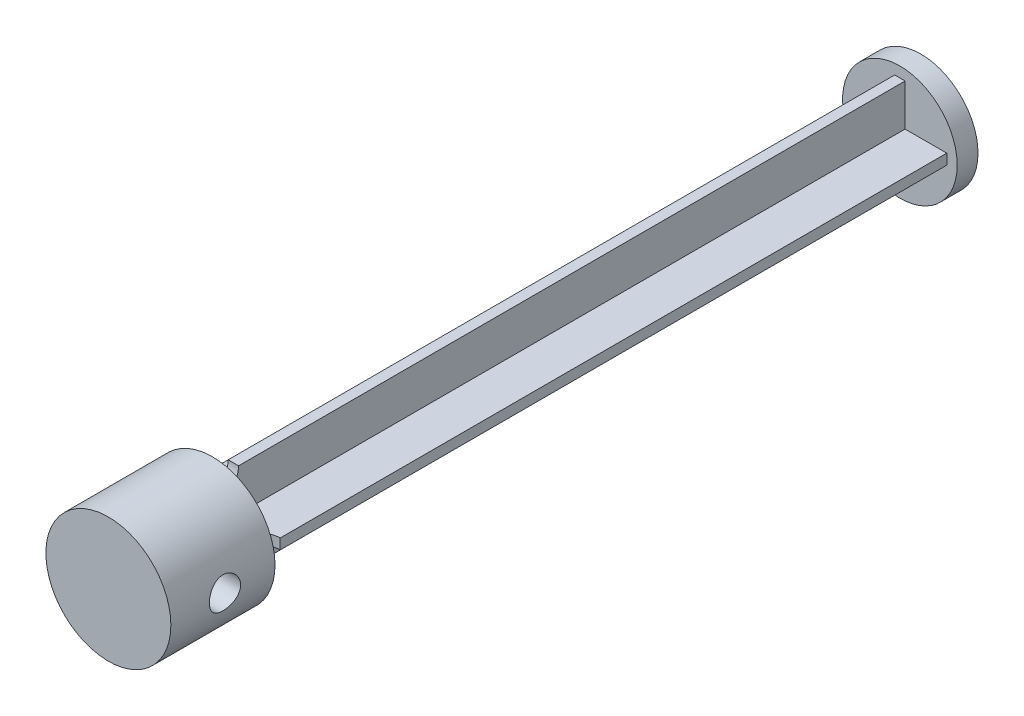
ISO-10303-21;
HEADER;
FILE_DESCRIPTION(('STEP AP214'),'2;1');
FILE_NAME('part.step','',(''),(''),'','','');
FILE_SCHEMA(('AUTOMOTIVE_DESIGN { 1 0 10303 214 1 1 1 1 }'));
ENDSEC;
DATA;
#1=APPLICATION_CONTEXT('core data for automotive mechanical design processes');
#2=APPLICATION_PROTOCOL_DEFINITION('international standard','automotive_design',2000,#1);
#3=PRODUCT_CONTEXT('',#1,'mechanical');
#4=PRODUCT('Part','Part','',(#3));
#5=PRODUCT_RELATED_PRODUCT_CATEGORY('part','',(#4));
#6=PRODUCT_DEFINITION_FORMATION('','',#4);
#7=PRODUCT_DEFINITION_CONTEXT('part definition',#1,'design');
#8=PRODUCT_DEFINITION('design','',#6,#7);
#9=PRODUCT_DEFINITION_SHAPE('','',#8);
#10=(LENGTH_UNIT() NAMED_UNIT(*) SI_UNIT(.MILLI.,.METRE.));
#11=(NAMED_UNIT(*) PLANE_ANGLE_UNIT() SI_UNIT($,.RADIAN.));
#12=(NAMED_UNIT(*) SI_UNIT($,.STERADIAN.) SOLID_ANGLE_UNIT());
#13=UNCERTAINTY_MEASURE_WITH_UNIT(LENGTH_MEASURE(1.E-05),#10,'distance_accuracy_value','');
#14=(GEOMETRIC_REPRESENTATION_CONTEXT(3) GLOBAL_UNCERTAINTY_ASSIGNED_CONTEXT((#13)) GLOBAL_UNIT_ASSIGNED_CONTEXT((#10,
#11,#12)) REPRESENTATION_CONTEXT('',''));
#15=CARTESIAN_POINT('',(0.,0.,0.));
#16=DIRECTION('',(0.,0.,1.));
#17=DIRECTION('',(1.,0.,0.));
#18=AXIS2_PLACEMENT_3D('',#15,#16,#17);
#19=CARTESIAN_POINT('',(0.,0.,2.54));
#20=DIRECTION('',(0.,0.,-1.));
#21=DIRECTION('',(-1.,0.,0.));
#22=AXIS2_PLACEMENT_3D('',#19,#20,#21);
#23=CYLINDRICAL_SURFACE('',#22,6.985);
#24=CARTESIAN_POINT('',(0.,0.,2.54));
#25=DIRECTION('',(0.,0.,1.));
#26=DIRECTION('',(1.,0.,0.));
#27=AXIS2_PLACEMENT_3D('',#24,#25,#26);
#28=CIRCLE('',#27,6.985);
#29=CARTESIAN_POINT('',(6.985,0.,2.54));
#30=VERTEX_POINT('',#29);
#31=EDGE_CURVE('E259',#30,#30,#28,.T.);
#32=ORIENTED_EDGE('',*,*,#31,.F.);
#33=EDGE_LOOP('',(#32));
#34=FACE_BOUND('',#33,.T.);
#35=CARTESIAN_POINT('',(0.,0.,0.));
#36=DIRECTION('',(0.,0.,1.));
#37=DIRECTION('',(1.,0.,0.));
#38=AXIS2_PLACEMENT_3D('',#35,#36,#37);
#39=CIRCLE('',#38,6.985);
#40=CARTESIAN_POINT('',(6.985,0.,0.));
#41=VERTEX_POINT('',#40);
#42=EDGE_CURVE('E258',#41,#41,#39,.T.);
#43=ORIENTED_EDGE('',*,*,#42,.T.);
#44=EDGE_LOOP('',(#43));
#45=FACE_BOUND('',#44,.T.);
#46=ADVANCED_FACE('F36',(#34,#45),#23,.T.);
#47=CARTESIAN_POINT('',(0.,0.,2.54));
#48=DIRECTION('',(0.,0.,1.));
#49=DIRECTION('',(1.,0.,0.));
#50=AXIS2_PLACEMENT_3D('',#47,#48,#49);
#51=PLANE('',#50);
#52=DIRECTION('',(0.,-1.,0.));
#53=VECTOR('',#52,1.);
#54=CARTESIAN_POINT('',(-0.635,-0.635,2.54));
#55=LINE('',#54,#53);
#56=CARTESIAN_POINT('',(-0.635,-0.635,2.54));
#57=VERTEX_POINT('',#56);
#58=CARTESIAN_POINT('',(-0.634999999999999,-5.715,2.54));
#59=VERTEX_POINT('',#58);
#60=EDGE_CURVE('E56',#57,#59,#55,.T.);
#61=ORIENTED_EDGE('',*,*,#60,.F.);
#62=DIRECTION('',(1.,0.,0.));
#63=VECTOR('',#62,1.);
#64=CARTESIAN_POINT('',(-0.635,-0.635,2.54));
#65=LINE('',#64,#63);
#66=CARTESIAN_POINT('',(-5.715,-0.635000000000001,2.54));
#67=VERTEX_POINT('',#66);
#68=EDGE_CURVE('E60',#67,#57,#65,.T.);
#69=ORIENTED_EDGE('',*,*,#68,.F.);
#70=DIRECTION('',(0.,-1.,0.));
#71=VECTOR('',#70,1.);
#72=CARTESIAN_POINT('',(-5.715,-0.635000000000001,2.54));
#73=LINE('',#72,#71);
#74=CARTESIAN_POINT('',(-5.715,0.635000000000001,2.54));
#75=VERTEX_POINT('',#74);
#76=EDGE_CURVE('E223',#75,#67,#73,.T.);
#77=ORIENTED_EDGE('',*,*,#76,.F.);
#78=DIRECTION('',(-1.,0.,0.));
#79=VECTOR('',#78,1.);
#80=CARTESIAN_POINT('',(-0.635,0.635,2.54));
#81=LINE('',#80,#79);
#82=CARTESIAN_POINT('',(-0.635,0.635,2.54));
#83=VERTEX_POINT('',#82);
#84=EDGE_CURVE('E221',#83,#75,#81,.T.);
#85=ORIENTED_EDGE('',*,*,#84,.F.);
#86=DIRECTION('',(0.,-1.,0.));
#87=VECTOR('',#86,1.);
#88=CARTESIAN_POINT('',(-0.635,0.635,2.54));
#89=LINE('',#88,#87);
#90=CARTESIAN_POINT('',(-0.635000000000001,5.715,2.54));
#91=VERTEX_POINT('',#90);
#92=EDGE_CURVE('E218',#91,#83,#89,.T.);
#93=ORIENTED_EDGE('',*,*,#92,.F.);
#94=DIRECTION('',(-1.,0.,0.));
#95=VECTOR('',#94,1.);
#96=CARTESIAN_POINT('',(-0.635000000000001,5.715,2.54));
#97=LINE('',#96,#95);
#98=CARTESIAN_POINT('',(0.634999999999999,5.715,2.54));
#99=VERTEX_POINT('',#98);
#100=EDGE_CURVE('E215',#99,#91,#97,.T.);
#101=ORIENTED_EDGE('',*,*,#100,.F.);
#102=DIRECTION('',(0.,1.,0.));
#103=VECTOR('',#102,1.);
#104=CARTESIAN_POINT('',(0.635,0.635,2.54));
#105=LINE('',#104,#103);
#106=CARTESIAN_POINT('',(0.635,0.635,2.54));
#107=VERTEX_POINT('',#106);
#108=EDGE_CURVE('E212',#107,#99,#105,.T.);
#109=ORIENTED_EDGE('',*,*,#108,.F.);
#110=DIRECTION('',(-1.,0.,0.));
#111=VECTOR('',#110,1.);
#112=CARTESIAN_POINT('',(0.635,0.635,2.54));
#113=LINE('',#112,#111);
#114=CARTESIAN_POINT('',(5.715,0.635,2.54));
#115=VERTEX_POINT('',#114);
#116=EDGE_CURVE('E209',#115,#107,#113,.T.);
#117=ORIENTED_EDGE('',*,*,#116,.F.);
#118=DIRECTION('',(0.,1.,0.));
#119=VECTOR('',#118,1.);
#120=CARTESIAN_POINT('',(5.715,-0.635,2.54));
#121=LINE('',#120,#119);
#122=CARTESIAN_POINT('',(5.715,-0.635,2.54));
#123=VERTEX_POINT('',#122);
#124=EDGE_CURVE('E206',#123,#115,#121,.T.);
#125=ORIENTED_EDGE('',*,*,#124,.F.);
#126=DIRECTION('',(1.,0.,0.));
#127=VECTOR('',#126,1.);
#128=CARTESIAN_POINT('',(0.635,-0.635,2.54));
#129=LINE('',#128,#127);
#130=CARTESIAN_POINT('',(0.635,-0.635,2.54));
#131=VERTEX_POINT('',#130);
#132=EDGE_CURVE('E203',#131,#123,#129,.T.);
#133=ORIENTED_EDGE('',*,*,#132,.F.);
#134=DIRECTION('',(0.,1.,0.));
#135=VECTOR('',#134,1.);
#136=CARTESIAN_POINT('',(0.635,-0.635,2.54));
#137=LINE('',#136,#135);
#138=CARTESIAN_POINT('',(0.634999999999999,-5.715,2.54));
#139=VERTEX_POINT('',#138);
#140=EDGE_CURVE('E200',#139,#131,#137,.T.);
#141=ORIENTED_EDGE('',*,*,#140,.F.);
#142=DIRECTION('',(1.,0.,0.));
#143=VECTOR('',#142,1.);
#144=CARTESIAN_POINT('',(0.634999999999999,-5.715,2.54));
#145=LINE('',#144,#143);
#146=EDGE_CURVE('E180',#59,#139,#145,.T.);
#147=ORIENTED_EDGE('',*,*,#146,.F.);
#148=EDGE_LOOP('',(#61,#69,#77,#85,#93,#101,#109,#117,#125,#133,#141,#147));
#149=FACE_BOUND('',#148,.T.);
#150=ORIENTED_EDGE('',*,*,#31,.T.);
#151=EDGE_LOOP('',(#150));
#152=FACE_BOUND('',#151,.T.);
#153=ADVANCED_FACE('F303',(#149,#152),#51,.T.);
#154=CARTESIAN_POINT('',(0.,0.,0.));
#155=DIRECTION('',(0.,0.,1.));
#156=DIRECTION('',(1.,0.,0.));
#157=AXIS2_PLACEMENT_3D('',#154,#155,#156);
#158=PLANE('',#157);
#159=ORIENTED_EDGE('',*,*,#42,.F.);
#160=EDGE_LOOP('',(#159));
#161=FACE_BOUND('',#160,.T.);
#162=ADVANCED_FACE('F309',(#161),#158,.F.);
#163=CARTESIAN_POINT('',(-0.635,-0.635,83.82));
#164=DIRECTION('',(1.,0.,0.));
#165=DIRECTION('',(0.,1.,0.));
#166=AXIS2_PLACEMENT_3D('',#163,#164,#165);
#167=PLANE('',#166);
#168=ORIENTED_EDGE('',*,*,#60,.T.);
#169=DIRECTION('',(0.,0.,-1.));
#170=VECTOR('',#169,1.);
#171=CARTESIAN_POINT('',(-0.634999999999999,-5.715,83.82));
#172=LINE('',#171,#170);
#173=CARTESIAN_POINT('',(-0.634999999999999,-5.715,83.82));
#174=VERTEX_POINT('',#173);
#175=EDGE_CURVE('E255',#174,#59,#172,.T.);
#176=ORIENTED_EDGE('',*,*,#175,.F.);
#177=CARTESIAN_POINT('',(-0.634999999999999,-5.715,86.36));
#178=DIRECTION('',(1.,0.,0.));
#179=DIRECTION('',(0.,1.,0.));
#180=AXIS2_PLACEMENT_3D('',#177,#178,#179);
#181=CIRCLE('',#180,2.54);
#182=CARTESIAN_POINT('',(-0.635000000000001,-3.175,86.36));
#183=VERTEX_POINT('',#182);
#184=EDGE_CURVE('E266',#174,#183,#181,.T.);
#185=ORIENTED_EDGE('',*,*,#184,.T.);
#186=DIRECTION('',(0.,-1.,0.));
#187=VECTOR('',#186,1.);
#188=CARTESIAN_POINT('',(-0.635000000000001,-3.175,86.36));
#189=LINE('',#188,#187);
#190=CARTESIAN_POINT('',(-0.635,-0.635,86.36));
#191=VERTEX_POINT('',#190);
#192=EDGE_CURVE('E357',#191,#183,#189,.T.);
#193=ORIENTED_EDGE('',*,*,#192,.F.);
#194=DIRECTION('',(0.,0.,-1.));
#195=VECTOR('',#194,1.);
#196=CARTESIAN_POINT('',(-0.635,-0.635,83.82));
#197=LINE('',#196,#195);
#198=EDGE_CURVE('E196',#191,#57,#197,.T.);
#199=ORIENTED_EDGE('',*,*,#198,.T.);
#200=EDGE_LOOP('',(#168,#176,#185,#193,#199));
#201=FACE_BOUND('',#200,.T.);
#202=ADVANCED_FACE('F372',(#201),#167,.F.);
#203=CARTESIAN_POINT('',(0.634999999999999,-5.715,83.82));
#204=DIRECTION('',(0.,1.,0.));
#205=DIRECTION('',(0.,0.,1.));
#206=AXIS2_PLACEMENT_3D('',#203,#204,#205);
#207=PLANE('',#206);
#208=ORIENTED_EDGE('',*,*,#146,.T.);
#209=DIRECTION('',(0.,0.,-1.));
#210=VECTOR('',#209,1.);
#211=CARTESIAN_POINT('',(0.634999999999999,-5.715,83.82));
#212=LINE('',#211,#210);
#213=CARTESIAN_POINT('',(0.634999999999999,-5.715,83.82));
#214=VERTEX_POINT('',#213);
#215=EDGE_CURVE('E252',#214,#139,#212,.T.);
#216=ORIENTED_EDGE('',*,*,#215,.F.);
#217=DIRECTION('',(1.,0.,0.));
#218=VECTOR('',#217,1.);
#219=CARTESIAN_POINT('',(0.634999999999999,-5.715,83.82));
#220=LINE('',#219,#218);
#221=EDGE_CURVE('E186',#174,#214,#220,.T.);
#222=ORIENTED_EDGE('',*,*,#221,.F.);
#223=ORIENTED_EDGE('',*,*,#175,.T.);
#224=EDGE_LOOP('',(#208,#216,#222,#223));
#225=FACE_BOUND('',#224,.T.);
#226=ADVANCED_FACE('F405',(#225),#207,.F.);
#227=CARTESIAN_POINT('',(0.635,-0.635,83.82));
#228=DIRECTION('',(-1.,0.,0.));
#229=DIRECTION('',(0.,-1.,0.));
#230=AXIS2_PLACEMENT_3D('',#227,#228,#229);
#231=PLANE('',#230);
#232=ORIENTED_EDGE('',*,*,#140,.T.);
#233=DIRECTION('',(0.,0.,-1.));
#234=VECTOR('',#233,1.);
#235=CARTESIAN_POINT('',(0.635,-0.635,83.82));
#236=LINE('',#235,#234);
#237=CARTESIAN_POINT('',(0.634999999999999,-0.635,86.36));
#238=VERTEX_POINT('',#237);
#239=EDGE_CURVE('E249',#238,#131,#236,.T.);
#240=ORIENTED_EDGE('',*,*,#239,.F.);
#241=DIRECTION('',(0.,1.,0.));
#242=VECTOR('',#241,1.);
#243=CARTESIAN_POINT('',(0.634999999999999,-3.175,86.36));
#244=LINE('',#243,#242);
#245=CARTESIAN_POINT('',(0.634999999999999,-3.175,86.36));
#246=VERTEX_POINT('',#245);
#247=EDGE_CURVE('E351',#246,#238,#244,.T.);
#248=ORIENTED_EDGE('',*,*,#247,.F.);
#249=CARTESIAN_POINT('',(0.634999999999999,-5.715,86.36));
#250=DIRECTION('',(-1.,0.,0.));
#251=DIRECTION('',(0.,-1.,0.));
#252=AXIS2_PLACEMENT_3D('',#249,#250,#251);
#253=CIRCLE('',#252,2.54);
#254=EDGE_CURVE('E262',#246,#214,#253,.T.);
#255=ORIENTED_EDGE('',*,*,#254,.T.);
#256=ORIENTED_EDGE('',*,*,#215,.T.);
#257=EDGE_LOOP('',(#232,#240,#248,#255,#256));
#258=FACE_BOUND('',#257,.T.);
#259=ADVANCED_FACE('F379',(#258),#231,.F.);
#260=CARTESIAN_POINT('',(0.635,-0.635,83.82));
#261=DIRECTION('',(0.,1.,0.));
#262=DIRECTION('',(-1.,0.,0.));
#263=AXIS2_PLACEMENT_3D('',#260,#261,#262);
#264=PLANE('',#263);
#265=ORIENTED_EDGE('',*,*,#132,.T.);
#266=DIRECTION('',(0.,0.,-1.));
#267=VECTOR('',#266,1.);
#268=CARTESIAN_POINT('',(5.715,-0.635,83.82));
#269=LINE('',#268,#267);
#270=CARTESIAN_POINT('',(5.715,-0.635,83.82));
#271=VERTEX_POINT('',#270);
#272=EDGE_CURVE('E246',#271,#123,#269,.T.);
#273=ORIENTED_EDGE('',*,*,#272,.F.);
#274=CARTESIAN_POINT('',(5.715,-0.635,86.36));
#275=DIRECTION('',(0.,1.,0.));
#276=DIRECTION('',(-1.,0.,0.));
#277=AXIS2_PLACEMENT_3D('',#274,#275,#276);
#278=CIRCLE('',#277,2.54);
#279=CARTESIAN_POINT('',(3.175,-0.635,86.36));
#280=VERTEX_POINT('',#279);
#281=EDGE_CURVE('E270',#271,#280,#278,.T.);
#282=ORIENTED_EDGE('',*,*,#281,.T.);
#283=DIRECTION('',(1.,0.,0.));
#284=VECTOR('',#283,1.);
#285=CARTESIAN_POINT('',(3.175,-0.635,86.36));
#286=LINE('',#285,#284);
#287=EDGE_CURVE('E348',#238,#280,#286,.T.);
#288=ORIENTED_EDGE('',*,*,#287,.F.);
#289=ORIENTED_EDGE('',*,*,#239,.T.);
#290=EDGE_LOOP('',(#265,#273,#282,#288,#289));
#291=FACE_BOUND('',#290,.T.);
#292=ADVANCED_FACE('F382',(#291),#264,.F.);
#293=CARTESIAN_POINT('',(5.715,-0.635,83.82));
#294=DIRECTION('',(-1.,0.,0.));
#295=DIRECTION('',(0.,-1.,0.));
#296=AXIS2_PLACEMENT_3D('',#293,#294,#295);
#297=PLANE('',#296);
#298=ORIENTED_EDGE('',*,*,#124,.T.);
#299=DIRECTION('',(0.,0.,-1.));
#300=VECTOR('',#299,1.);
#301=CARTESIAN_POINT('',(5.715,0.635,83.82));
#302=LINE('',#301,#300);
#303=CARTESIAN_POINT('',(5.715,0.635,83.82));
#304=VERTEX_POINT('',#303);
#305=EDGE_CURVE('E243',#304,#115,#302,.T.);
#306=ORIENTED_EDGE('',*,*,#305,.F.);
#307=DIRECTION('',(0.,1.,0.));
#308=VECTOR('',#307,1.);
#309=CARTESIAN_POINT('',(5.715,-0.635,83.82));
#310=LINE('',#309,#308);
#311=EDGE_CURVE('E189',#271,#304,#310,.T.);
#312=ORIENTED_EDGE('',*,*,#311,.F.);
#313=ORIENTED_EDGE('',*,*,#272,.T.);
#314=EDGE_LOOP('',(#298,#306,#312,#313));
#315=FACE_BOUND('',#314,.T.);
#316=ADVANCED_FACE('F392',(#315),#297,.F.);
#317=CARTESIAN_POINT('',(0.635,0.635,83.82));
#318=DIRECTION('',(0.,-1.,0.));
#319=DIRECTION('',(1.,0.,0.));
#320=AXIS2_PLACEMENT_3D('',#317,#318,#319);
#321=PLANE('',#320);
#322=ORIENTED_EDGE('',*,*,#116,.T.);
#323=DIRECTION('',(0.,0.,-1.));
#324=VECTOR('',#323,1.);
#325=CARTESIAN_POINT('',(0.635,0.635,83.82));
#326=LINE('',#325,#324);
#327=CARTESIAN_POINT('',(0.635,0.635,86.36));
#328=VERTEX_POINT('',#327);
#329=EDGE_CURVE('E240',#328,#107,#326,.T.);
#330=ORIENTED_EDGE('',*,*,#329,.F.);
#331=DIRECTION('',(-1.,0.,0.));
#332=VECTOR('',#331,1.);
#333=CARTESIAN_POINT('',(3.175,0.635,86.36));
#334=LINE('',#333,#332);
#335=CARTESIAN_POINT('',(3.175,0.635,86.36));
#336=VERTEX_POINT('',#335);
#337=EDGE_CURVE('E341',#336,#328,#334,.T.);
#338=ORIENTED_EDGE('',*,*,#337,.F.);
#339=CARTESIAN_POINT('',(5.715,0.635,86.36));
#340=DIRECTION('',(0.,-1.,0.));
#341=DIRECTION('',(1.,0.,0.));
#342=AXIS2_PLACEMENT_3D('',#339,#340,#341);
#343=CIRCLE('',#342,2.54);
#344=EDGE_CURVE('E268',#336,#304,#343,.T.);
#345=ORIENTED_EDGE('',*,*,#344,.T.);
#346=ORIENTED_EDGE('',*,*,#305,.T.);
#347=EDGE_LOOP('',(#322,#330,#338,#345,#346));
#348=FACE_BOUND('',#347,.T.);
#349=ADVANCED_FACE('F388',(#348),#321,.F.);
#350=CARTESIAN_POINT('',(0.635,0.635,83.82));
#351=DIRECTION('',(-1.,0.,0.));
#352=DIRECTION('',(0.,-1.,0.));
#353=AXIS2_PLACEMENT_3D('',#350,#351,#352);
#354=PLANE('',#353);
#355=ORIENTED_EDGE('',*,*,#108,.T.);
#356=DIRECTION('',(0.,0.,-1.));
#357=VECTOR('',#356,1.);
#358=CARTESIAN_POINT('',(0.634999999999999,5.715,83.82));
#359=LINE('',#358,#357);
#360=CARTESIAN_POINT('',(0.634999999999999,5.715,83.82));
#361=VERTEX_POINT('',#360);
#362=EDGE_CURVE('E237',#361,#99,#359,.T.);
#363=ORIENTED_EDGE('',*,*,#362,.F.);
#364=CARTESIAN_POINT('',(0.634999999999999,5.715,86.36));
#365=DIRECTION('',(-1.,0.,0.));
#366=DIRECTION('',(0.,-1.,0.));
#367=AXIS2_PLACEMENT_3D('',#364,#365,#366);
#368=CIRCLE('',#367,2.54);
#369=CARTESIAN_POINT('',(0.634999999999999,3.175,86.36));
#370=VERTEX_POINT('',#369);
#371=EDGE_CURVE('E274',#361,#370,#368,.T.);
#372=ORIENTED_EDGE('',*,*,#371,.T.);
#373=DIRECTION('',(0.,1.,0.));
#374=VECTOR('',#373,1.);
#375=CARTESIAN_POINT('',(0.634999999999999,3.175,86.36));
#376=LINE('',#375,#374);
#377=EDGE_CURVE('E334',#328,#370,#376,.T.);
#378=ORIENTED_EDGE('',*,*,#377,.F.);
#379=ORIENTED_EDGE('',*,*,#329,.T.);
#380=EDGE_LOOP('',(#355,#363,#372,#378,#379));
#381=FACE_BOUND('',#380,.T.);
#382=ADVANCED_FACE('F333',(#381),#354,.F.);
#383=CARTESIAN_POINT('',(-0.635000000000001,5.715,83.82));
#384=DIRECTION('',(0.,-1.,0.));
#385=DIRECTION('',(0.,0.,-1.));
#386=AXIS2_PLACEMENT_3D('',#383,#384,#385);
#387=PLANE('',#386);
#388=ORIENTED_EDGE('',*,*,#100,.T.);
#389=DIRECTION('',(0.,0.,-1.));
#390=VECTOR('',#389,1.);
#391=CARTESIAN_POINT('',(-0.635000000000001,5.715,83.82));
#392=LINE('',#391,#390);
#393=CARTESIAN_POINT('',(-0.635000000000001,5.715,83.82));
#394=VERTEX_POINT('',#393);
#395=EDGE_CURVE('E234',#394,#91,#392,.T.);
#396=ORIENTED_EDGE('',*,*,#395,.F.);
#397=DIRECTION('',(-1.,0.,0.));
#398=VECTOR('',#397,1.);
#399=CARTESIAN_POINT('',(-0.635000000000001,5.715,83.82));
#400=LINE('',#399,#398);
#401=EDGE_CURVE('E192',#361,#394,#400,.T.);
#402=ORIENTED_EDGE('',*,*,#401,.F.);
#403=ORIENTED_EDGE('',*,*,#362,.T.);
#404=EDGE_LOOP('',(#388,#396,#402,#403));
#405=FACE_BOUND('',#404,.T.);
#406=ADVANCED_FACE('F338',(#405),#387,.F.);
#407=CARTESIAN_POINT('',(-0.635,0.635,83.82));
#408=DIRECTION('',(1.,0.,0.));
#409=DIRECTION('',(0.,1.,0.));
#410=AXIS2_PLACEMENT_3D('',#407,#408,#409);
#411=PLANE('',#410);
#412=ORIENTED_EDGE('',*,*,#92,.T.);
#413=DIRECTION('',(0.,0.,-1.));
#414=VECTOR('',#413,1.);
#415=CARTESIAN_POINT('',(-0.635,0.635,83.82));
#416=LINE('',#415,#414);
#417=CARTESIAN_POINT('',(-0.635000000000001,0.635,86.36));
#418=VERTEX_POINT('',#417);
#419=EDGE_CURVE('E232',#418,#83,#416,.T.);
#420=ORIENTED_EDGE('',*,*,#419,.F.);
#421=DIRECTION('',(0.,-1.,0.));
#422=VECTOR('',#421,1.);
#423=CARTESIAN_POINT('',(-0.635000000000001,3.175,86.36));
#424=LINE('',#423,#422);
#425=CARTESIAN_POINT('',(-0.635000000000001,3.175,86.36));
#426=VERTEX_POINT('',#425);
#427=EDGE_CURVE('E178',#426,#418,#424,.T.);
#428=ORIENTED_EDGE('',*,*,#427,.F.);
#429=CARTESIAN_POINT('',(-0.635000000000001,5.715,86.36));
#430=DIRECTION('',(1.,0.,0.));
#431=DIRECTION('',(0.,1.,0.));
#432=AXIS2_PLACEMENT_3D('',#429,#430,#431);
#433=CIRCLE('',#432,2.54);
#434=EDGE_CURVE('E272',#426,#394,#433,.T.);
#435=ORIENTED_EDGE('',*,*,#434,.T.);
#436=ORIENTED_EDGE('',*,*,#395,.T.);
#437=EDGE_LOOP('',(#412,#420,#428,#435,#436));
#438=FACE_BOUND('',#437,.T.);
#439=ADVANCED_FACE('F340',(#438),#411,.F.);
#440=CARTESIAN_POINT('',(-0.635,0.635,83.82));
#441=DIRECTION('',(0.,-1.,0.));
#442=DIRECTION('',(1.,0.,0.));
#443=AXIS2_PLACEMENT_3D('',#440,#441,#442);
#444=PLANE('',#443);
#445=ORIENTED_EDGE('',*,*,#84,.T.);
#446=DIRECTION('',(0.,0.,-1.));
#447=VECTOR('',#446,1.);
#448=CARTESIAN_POINT('',(-5.715,0.635000000000001,83.82));
#449=LINE('',#448,#447);
#450=CARTESIAN_POINT('',(-5.715,0.635000000000001,83.82));
#451=VERTEX_POINT('',#450);
#452=EDGE_CURVE('E172',#451,#75,#449,.T.);
#453=ORIENTED_EDGE('',*,*,#452,.F.);
#454=CARTESIAN_POINT('',(-5.715,0.635000000000001,86.36));
#455=DIRECTION('',(0.,-1.,0.));
#456=DIRECTION('',(1.,0.,0.));
#457=AXIS2_PLACEMENT_3D('',#454,#455,#456);
#458=CIRCLE('',#457,2.54);
#459=CARTESIAN_POINT('',(-3.175,0.635,86.36));
#460=VERTEX_POINT('',#459);
#461=EDGE_CURVE('E155',#451,#460,#458,.T.);
#462=ORIENTED_EDGE('',*,*,#461,.T.);
#463=DIRECTION('',(-1.,0.,0.));
#464=VECTOR('',#463,1.);
#465=CARTESIAN_POINT('',(-3.175,0.635,86.36));
#466=LINE('',#465,#464);
#467=EDGE_CURVE('E169',#418,#460,#466,.T.);
#468=ORIENTED_EDGE('',*,*,#467,.F.);
#469=ORIENTED_EDGE('',*,*,#419,.T.);
#470=EDGE_LOOP('',(#445,#453,#462,#468,#469));
#471=FACE_BOUND('',#470,.T.);
#472=ADVANCED_FACE('F167',(#471),#444,.F.);
#473=CARTESIAN_POINT('',(-5.715,-0.635000000000001,83.82));
#474=DIRECTION('',(1.,0.,0.));
#475=DIRECTION('',(0.,0.,-1.));
#476=AXIS2_PLACEMENT_3D('',#473,#474,#475);
#477=PLANE('',#476);
#478=ORIENTED_EDGE('',*,*,#76,.T.);
#479=DIRECTION('',(0.,0.,-1.));
#480=VECTOR('',#479,1.);
#481=CARTESIAN_POINT('',(-5.715,-0.635000000000001,83.82));
#482=LINE('',#481,#480);
#483=CARTESIAN_POINT('',(-5.715,-0.635000000000001,83.82));
#484=VERTEX_POINT('',#483);
#485=EDGE_CURVE('E228',#484,#67,#482,.T.);
#486=ORIENTED_EDGE('',*,*,#485,.F.);
#487=DIRECTION('',(0.,-1.,0.));
#488=VECTOR('',#487,1.);
#489=CARTESIAN_POINT('',(-5.715,-0.635000000000001,83.82));
#490=LINE('',#489,#488);
#491=EDGE_CURVE('E195',#451,#484,#490,.T.);
#492=ORIENTED_EDGE('',*,*,#491,.F.);
#493=ORIENTED_EDGE('',*,*,#452,.T.);
#494=EDGE_LOOP('',(#478,#486,#492,#493));
#495=FACE_BOUND('',#494,.T.);
#496=ADVANCED_FACE('F453',(#495),#477,.F.);
#497=CARTESIAN_POINT('',(-0.635,-0.635,83.82));
#498=DIRECTION('',(0.,1.,0.));
#499=DIRECTION('',(-1.,0.,0.));
#500=AXIS2_PLACEMENT_3D('',#497,#498,#499);
#501=PLANE('',#500);
#502=ORIENTED_EDGE('',*,*,#68,.T.);
#503=ORIENTED_EDGE('',*,*,#198,.F.);
#504=DIRECTION('',(1.,0.,0.));
#505=VECTOR('',#504,1.);
#506=CARTESIAN_POINT('',(-3.175,-0.635,86.36));
#507=LINE('',#506,#505);
#508=CARTESIAN_POINT('',(-3.175,-0.635,86.36));
#509=VERTEX_POINT('',#508);
#510=EDGE_CURVE('E161',#509,#191,#507,.T.);
#511=ORIENTED_EDGE('',*,*,#510,.F.);
#512=CARTESIAN_POINT('',(-5.715,-0.635000000000001,86.36));
#513=DIRECTION('',(0.,1.,0.));
#514=DIRECTION('',(-1.,0.,0.));
#515=AXIS2_PLACEMENT_3D('',#512,#513,#514);
#516=CIRCLE('',#515,2.54);
#517=EDGE_CURVE('E156',#509,#484,#516,.T.);
#518=ORIENTED_EDGE('',*,*,#517,.T.);
#519=ORIENTED_EDGE('',*,*,#485,.T.);
#520=EDGE_LOOP('',(#502,#503,#511,#518,#519));
#521=FACE_BOUND('',#520,.T.);
#522=ADVANCED_FACE('F319',(#521),#501,.F.);
#523=CARTESIAN_POINT('',(0.634999999999999,-5.715,86.36));
#524=DIRECTION('',(-1.,0.,0.));
#525=DIRECTION('',(0.,0.,1.));
#526=AXIS2_PLACEMENT_3D('',#523,#524,#525);
#527=CYLINDRICAL_SURFACE('',#526,2.54);
#528=ORIENTED_EDGE('',*,*,#184,.F.);
#529=ORIENTED_EDGE('',*,*,#221,.T.);
#530=ORIENTED_EDGE('',*,*,#254,.F.);
#531=DIRECTION('',(1.,0.,0.));
#532=VECTOR('',#531,1.);
#533=CARTESIAN_POINT('',(0.634999999999999,-3.175,86.36));
#534=LINE('',#533,#532);
#535=EDGE_CURVE('E354',#183,#246,#534,.T.);
#536=ORIENTED_EDGE('',*,*,#535,.F.);
#537=EDGE_LOOP('',(#528,#529,#530,#536));
#538=FACE_BOUND('',#537,.T.);
#539=ADVANCED_FACE('F315',(#538),#527,.F.);
#540=CARTESIAN_POINT('',(5.715,0.635,86.36));
#541=DIRECTION('',(0.,-1.,0.));
#542=DIRECTION('',(0.,0.,-1.));
#543=AXIS2_PLACEMENT_3D('',#540,#541,#542);
#544=CYLINDRICAL_SURFACE('',#543,2.54);
#545=ORIENTED_EDGE('',*,*,#281,.F.);
#546=ORIENTED_EDGE('',*,*,#311,.T.);
#547=ORIENTED_EDGE('',*,*,#344,.F.);
#548=DIRECTION('',(0.,1.,0.));
#549=VECTOR('',#548,1.);
#550=CARTESIAN_POINT('',(3.175,0.635,86.36));
#551=LINE('',#550,#549);
#552=EDGE_CURVE('E345',#280,#336,#551,.T.);
#553=ORIENTED_EDGE('',*,*,#552,.F.);
#554=EDGE_LOOP('',(#545,#546,#547,#553));
#555=FACE_BOUND('',#554,.T.);
#556=ADVANCED_FACE('F318',(#555),#544,.F.);
#557=CARTESIAN_POINT('',(-0.635,5.715,86.36));
#558=DIRECTION('',(1.,0.,0.));
#559=DIRECTION('',(0.,1.,0.));
#560=AXIS2_PLACEMENT_3D('',#557,#558,#559);
#561=CYLINDRICAL_SURFACE('',#560,2.54);
#562=ORIENTED_EDGE('',*,*,#371,.F.);
#563=ORIENTED_EDGE('',*,*,#401,.T.);
#564=ORIENTED_EDGE('',*,*,#434,.F.);
#565=DIRECTION('',(-1.,0.,0.));
#566=VECTOR('',#565,1.);
#567=CARTESIAN_POINT('',(-0.635000000000001,3.175,86.36));
#568=LINE('',#567,#566);
#569=EDGE_CURVE('E182',#370,#426,#568,.T.);
#570=ORIENTED_EDGE('',*,*,#569,.F.);
#571=EDGE_LOOP('',(#562,#563,#564,#570));
#572=FACE_BOUND('',#571,.T.);
#573=ADVANCED_FACE('F300',(#572),#561,.F.);
#574=CARTESIAN_POINT('',(-5.715,0.635,86.36));
#575=DIRECTION('',(0.,1.,0.));
#576=DIRECTION('',(0.,0.,1.));
#577=AXIS2_PLACEMENT_3D('',#574,#575,#576);
#578=CYLINDRICAL_SURFACE('',#577,2.54);
#579=ORIENTED_EDGE('',*,*,#461,.F.);
#580=ORIENTED_EDGE('',*,*,#491,.T.);
#581=ORIENTED_EDGE('',*,*,#517,.F.);
#582=DIRECTION('',(0.,-1.,0.));
#583=VECTOR('',#582,1.);
#584=CARTESIAN_POINT('',(-3.175,0.635,86.36));
#585=LINE('',#584,#583);
#586=EDGE_CURVE('E152',#460,#509,#585,.T.);
#587=ORIENTED_EDGE('',*,*,#586,.F.);
#588=EDGE_LOOP('',(#579,#580,#581,#587));
#589=FACE_BOUND('',#588,.T.);
#590=ADVANCED_FACE('F38',(#589),#578,.F.);
#591=CARTESIAN_POINT('',(0.,0.,86.36));
#592=DIRECTION('',(0.,0.,1.));
#593=DIRECTION('',(1.,0.,0.));
#594=AXIS2_PLACEMENT_3D('',#591,#592,#593);
#595=PLANE('',#594);
#596=CARTESIAN_POINT('',(0.,0.,86.36));
#597=DIRECTION('',(0.,0.,1.));
#598=DIRECTION('',(1.,0.,0.));
#599=AXIS2_PLACEMENT_3D('',#596,#597,#598);
#600=CIRCLE('',#599,7.62);
#601=CARTESIAN_POINT('',(7.62,0.,86.36));
#602=VERTEX_POINT('',#601);
#603=EDGE_CURVE('E361',#602,#602,#600,.T.);
#604=ORIENTED_EDGE('',*,*,#603,.F.);
#605=EDGE_LOOP('',(#604));
#606=FACE_BOUND('',#605,.T.);
#607=ORIENTED_EDGE('',*,*,#467,.T.);
#608=ORIENTED_EDGE('',*,*,#586,.T.);
#609=ORIENTED_EDGE('',*,*,#510,.T.);
#610=ORIENTED_EDGE('',*,*,#192,.T.);
#611=ORIENTED_EDGE('',*,*,#535,.T.);
#612=ORIENTED_EDGE('',*,*,#247,.T.);
#613=ORIENTED_EDGE('',*,*,#287,.T.);
#614=ORIENTED_EDGE('',*,*,#552,.T.);
#615=ORIENTED_EDGE('',*,*,#337,.T.);
#616=ORIENTED_EDGE('',*,*,#377,.T.);
#617=ORIENTED_EDGE('',*,*,#569,.T.);
#618=ORIENTED_EDGE('',*,*,#427,.T.);
#619=EDGE_LOOP('',(#607,#608,#609,#610,#611,#612,#613,#614,#615,#616,#617,#618));
#620=FACE_BOUND('',#619,.T.);
#621=ADVANCED_FACE('F175',(#606,#620),#595,.F.);
#622=CARTESIAN_POINT('',(0.,0.,99.06));
#623=DIRECTION('',(0.,0.,-1.));
#624=DIRECTION('',(-1.,0.,0.));
#625=AXIS2_PLACEMENT_3D('',#622,#623,#624);
#626=CYLINDRICAL_SURFACE('',#625,7.62);
#627=CARTESIAN_POINT('',(-7.62,0.,94.3634709835372));
#628=CARTESIAN_POINT('',(-7.61999822032376,-0.105252632610559,94.3634680298498));
#629=CARTESIAN_POINT('',(-7.61779754227422,-0.210538260445071,94.3547187140545));
#630=CARTESIAN_POINT('',(-7.60923184563963,-0.418092031188579,94.3200050413773));
#631=CARTESIAN_POINT('',(-7.6028644668336,-0.520358429525842,94.2940309274241));
#632=CARTESIAN_POINT('',(-7.5866704544169,-0.718846507671875,94.2257531316404));
#633=CARTESIAN_POINT('',(-7.5768479760945,-0.815075285556106,94.1834690591688));
#634=CARTESIAN_POINT('',(-7.55478986635643,-0.999073607518624,94.0838406181803));
#635=CARTESIAN_POINT('',(-7.54255415354644,-1.08684286612293,94.0264957416662));
#636=CARTESIAN_POINT('',(-7.51671615261587,-1.25323844767217,93.8971259806764));
#637=CARTESIAN_POINT('',(-7.50309278078637,-1.33166572637757,93.8248492833391));
#638=CARTESIAN_POINT('',(-7.47615497549262,-1.4754211375482,93.6682066833029));
#639=CARTESIAN_POINT('',(-7.46284057706202,-1.54074779092541,93.5838394173952));
#640=CARTESIAN_POINT('',(-7.43781565138632,-1.65738370935478,93.4038650455807));
#641=CARTESIAN_POINT('',(-7.42613188977668,-1.70847031422521,93.308109580408));
#642=CARTESIAN_POINT('',(-7.40599858411523,-1.79374407385918,93.1090305007311));
#643=CARTESIAN_POINT('',(-7.39754852304441,-1.82793393040797,93.0057080992135));
#644=CARTESIAN_POINT('',(-7.38505605431289,-1.87776464274146,92.7966167408201));
#645=CARTESIAN_POINT('',(-7.3809287366579,-1.89376338078335,92.690938265554));
#646=CARTESIAN_POINT('',(-7.3772949042293,-1.90787245433618,92.4783229008895));
#647=CARTESIAN_POINT('',(-7.37778763769777,-1.90598570010884,92.37138621905));
#648=CARTESIAN_POINT('',(-7.38326190980705,-1.8846628862919,92.1620329077017));
#649=CARTESIAN_POINT('',(-7.38813436012386,-1.86565329204197,92.0595695442765));
#650=CARTESIAN_POINT('',(-7.40164521289134,-1.81130471736696,91.8593344488799));
#651=CARTESIAN_POINT('',(-7.41028388362784,-1.77596457362818,91.7615630516904));
#652=CARTESIAN_POINT('',(-7.43045394658317,-1.6895946369802,91.5723437028971));
#653=CARTESIAN_POINT('',(-7.44201365886165,-1.63841006738581,91.4809695453645));
#654=CARTESIAN_POINT('',(-7.4667073277491,-1.521912470539,91.307954222146));
#655=CARTESIAN_POINT('',(-7.47984155965113,-1.45659697098724,91.2263147634918));
#656=CARTESIAN_POINT('',(-7.50666368285522,-1.31148254934516,91.0726423916053));
#657=CARTESIAN_POINT('',(-7.52035668237023,-1.23132374787065,91.0009497811593));
#658=CARTESIAN_POINT('',(-7.54641576285058,-1.0599571352297,90.871960005608));
#659=CARTESIAN_POINT('',(-7.55878180327757,-0.968748986689097,90.8146632802225));
#660=CARTESIAN_POINT('',(-7.58085519759611,-0.777387178625377,90.7159667390322));
#661=CARTESIAN_POINT('',(-7.59055327362211,-0.67720386937496,90.6746222014141));
#662=CARTESIAN_POINT('',(-7.60613054579101,-0.471012530341468,90.609456005286));
#663=CARTESIAN_POINT('',(-7.61201047240887,-0.365005618921123,90.5856309948862));
#664=CARTESIAN_POINT('',(-7.61918084074646,-0.153085762395342,90.5566998752775));
#665=CARTESIAN_POINT('',(-7.62058487955514,-0.0472398343850333,90.5511303404216));
#666=CARTESIAN_POINT('',(-7.61896882114352,0.16387175099791,90.5575972161477));
#667=CARTESIAN_POINT('',(-7.61594912217145,0.269137459748631,90.5696320418921));
#668=CARTESIAN_POINT('',(-7.60589768031743,0.474490121346138,90.6105840371943));
#669=CARTESIAN_POINT('',(-7.5989260541598,0.574630701090309,90.639248388153));
#670=CARTESIAN_POINT('',(-7.5817565742535,0.76867676141468,90.7123569802533));
#671=CARTESIAN_POINT('',(-7.57155839469763,0.862581611171439,90.7568028150149));
#672=CARTESIAN_POINT('',(-7.54879501066414,1.0433343807259,90.8611108672081));
#673=CARTESIAN_POINT('',(-7.53619101556004,1.1300275111315,90.9212326462811));
#674=CARTESIAN_POINT('',(-7.51007526668022,1.29225879932692,91.0548541677094));
#675=CARTESIAN_POINT('',(-7.49656335649665,1.36779502789572,91.1283562188507));
#676=CARTESIAN_POINT('',(-7.46974575340179,1.50747802145236,91.2888034738097));
#677=CARTESIAN_POINT('',(-7.45645326317847,1.57129971187998,91.3760343663503));
#678=CARTESIAN_POINT('',(-7.43194955539093,1.68339866394612,91.5602414293087));
#679=CARTESIAN_POINT('',(-7.42073824545123,1.73167661558058,91.6572171668961));
#680=CARTESIAN_POINT('',(-7.40178980313025,1.8109583041738,91.8576412510018));
#681=CARTESIAN_POINT('',(-7.3940321422072,1.84206438375066,91.9610470715341));
#682=CARTESIAN_POINT('',(-7.38284964994533,1.8863889881413,92.1718442236564));
#683=CARTESIAN_POINT('',(-7.37942387104319,1.8996114248979,92.2792346783485));
#684=CARTESIAN_POINT('',(-7.37736524529025,1.90758900972418,92.4916446838333));
#685=CARTESIAN_POINT('',(-7.37859754564895,1.90286373018075,92.5966437261456));
#686=CARTESIAN_POINT('',(-7.3854044443996,1.87626914345734,92.8042969221456));
#687=CARTESIAN_POINT('',(-7.39097895552658,1.8544001808122,92.9069511229145));
#688=CARTESIAN_POINT('',(-7.40576701067057,1.79442277569236,93.1064357265503));
#689=CARTESIAN_POINT('',(-7.41495869350113,1.75641178394409,93.2032971611922));
#690=CARTESIAN_POINT('',(-7.43594849770532,1.66530644027845,93.3893370195836));
#691=CARTESIAN_POINT('',(-7.44774698053381,1.61220999634343,93.4785143754846));
#692=CARTESIAN_POINT('',(-7.4730055551466,1.49081204076916,93.6491653623698));
#693=CARTESIAN_POINT('',(-7.48650096336331,1.42215001689856,93.7303773467856));
#694=CARTESIAN_POINT('',(-7.51342194602783,1.27227250141096,93.8802957304274));
#695=CARTESIAN_POINT('',(-7.52684750313366,1.19105403300165,93.9489991557807));
#696=CARTESIAN_POINT('',(-7.55240622672532,1.01659383511229,94.0731633454143));
#697=CARTESIAN_POINT('',(-7.56451158374652,0.923160996341812,94.1283617429001));
#698=CARTESIAN_POINT('',(-7.585772547184,0.728047895578305,94.2221802614717));
#699=CARTESIAN_POINT('',(-7.59493026603722,0.626373605564659,94.2608122615609));
#700=CARTESIAN_POINT('',(-7.60791035648238,0.437401021619208,94.3146672080559));
#701=CARTESIAN_POINT('',(-7.61241283016917,0.351002817053246,94.3329290622151));
#702=CARTESIAN_POINT('',(-7.61845828644574,0.176410710851079,94.3573317319371));
#703=CARTESIAN_POINT('',(-7.62000149162635,0.0882169447781223,94.363473459155));
#704=CARTESIAN_POINT('',(-7.62,0.,94.3634709835372));
#705=B_SPLINE_CURVE_WITH_KNOTS('',3,(#627,#628,#629,#630,#631,#632,#633,#634,#635,#636,#637,
#638,#639,#640,#641,#642,#643,#644,#645,#646,#647,#648,#649,#650,#651,#652,#653,#654,#655,#656,
#657,#658,#659,#660,#661,#662,#663,#664,#665,#666,#667,#668,#669,#670,#671,#672,#673,#674,#675,
#676,#677,#678,#679,#680,#681,#682,#683,#684,#685,#686,#687,#688,#689,#690,#691,#692,#693,#694,
#695,#696,#697,#698,#699,#700,#701,#702,#703,#704),.UNSPECIFIED.,.T.,.F.,(4,2,2,2,2,2,2,2,2,2,2,
2,2,2,2,2,2,2,2,2,2,2,2,2,2,2,2,2,2,2,2,2,2,2,2,2,2,2,4),(0.,0.315434614839302,
0.631048061960156,0.946283225903353,1.26152902401505,1.58260333005167,1.9037138656668,
2.22959482383176,2.555423656851,2.87472494776279,3.19397428403126,3.50548571198915,
3.81701933401871,4.13169770399828,4.44643117361929,4.77013906230657,5.09385683738976,
5.41868650841577,5.74345401584579,6.05991052365583,6.37633854413186,6.6880774863283,
6.99984791699312,7.31715056208,7.63450801020187,7.95965526689687,8.28478808811878,
8.6079616335983,8.9310644753056,9.24488601106242,9.55870124014166,9.87064828710498,
10.1826386153387,10.5027676204059,10.8229726360843,11.1489767558448,11.4747467205312,
11.7391464853653,12.0035263617466),.UNSPECIFIED.);
#706=CARTESIAN_POINT('',(-7.62,0.,94.3634709835372));
#707=VERTEX_POINT('',#706);
#708=EDGE_CURVE('E11',#707,#707,#705,.T.);
#709=ORIENTED_EDGE('',*,*,#708,.T.);
#710=EDGE_LOOP('',(#709));
#711=FACE_BOUND('',#710,.T.);
#712=CARTESIAN_POINT('',(7.37803327452512,1.90500000000001,92.4584709835372));
#713=CARTESIAN_POINT('',(7.37803528266949,1.90499701188793,92.3532763113312));
#714=CARTESIAN_POINT('',(7.38030761183123,1.89625699906922,92.2480485707442));
#715=CARTESIAN_POINT('',(7.38912818838333,1.86158362160342,92.040614888969));
#716=CARTESIAN_POINT('',(7.39567892429682,1.83564025053749,91.9384107426325));
#717=CARTESIAN_POINT('',(7.41226908142266,1.76745229411963,91.7400546874386));
#718=CARTESIAN_POINT('',(7.42230399730128,1.72522875262513,91.6438951511333));
#719=CARTESIAN_POINT('',(7.44472622325914,1.62574310964118,91.4600141139018));
#720=CARTESIAN_POINT('',(7.45711363320408,1.56848036968325,91.3722929714321));
#721=CARTESIAN_POINT('',(7.48315025862986,1.43919582161167,91.2058484098474));
#722=CARTESIAN_POINT('',(7.49681963388751,1.36690370843051,91.1273380600705));
#723=CARTESIAN_POINT('',(7.52370511142653,1.21019473284473,90.9834208010346));
#724=CARTESIAN_POINT('',(7.53692117123588,1.12577673816541,90.9180151168134));
#725=CARTESIAN_POINT('',(7.56163396626684,0.945752643222175,90.8012920772022));
#726=CARTESIAN_POINT('',(7.57310413799251,0.850006867060696,90.7501840357582));
#727=CARTESIAN_POINT('',(7.59280278687599,0.6509485464311,90.6648680346925));
#728=CARTESIAN_POINT('',(7.6010317422877,0.547637120973471,90.6306575815776));
#729=CARTESIAN_POINT('',(7.61317826242313,0.338601374170682,90.5807903335883));
#730=CARTESIAN_POINT('',(7.61717979109367,0.232968332296331,90.5647717145604));
#731=CARTESIAN_POINT('',(7.62071318709761,0.020443560278242,90.5506070985292));
#732=CARTESIAN_POINT('',(7.62024571525688,-0.0864479814379969,90.5524584591135));
#733=CARTESIAN_POINT('',(7.61495628354593,-0.295946030863388,90.5737210194278));
#734=CARTESIAN_POINT('',(7.61023117783746,-0.398594990720023,90.5927416632282));
#735=CARTESIAN_POINT('',(7.59707017431939,-0.599195361323066,90.6471750913142));
#736=CARTESIAN_POINT('',(7.58863407897612,-0.697146521700679,90.6825887481948));
#737=CARTESIAN_POINT('',(7.56885082392082,-0.886599770170935,90.7691189424008));
#738=CARTESIAN_POINT('',(7.55747805007631,-0.978035591105182,90.8203744715695));
#739=CARTESIAN_POINT('',(7.53305506702953,-1.15114506055862,90.9370280110238));
#740=CARTESIAN_POINT('',(7.52000456615197,-1.23281700683788,91.0024284817804));
#741=CARTESIAN_POINT('',(7.49323149892375,-1.38640953683684,91.1476090449278));
#742=CARTESIAN_POINT('',(7.47950030278749,-1.45800637863825,91.2277304115062));
#743=CARTESIAN_POINT('',(7.4532366315973,-1.58681999620955,91.3989861633749));
#744=CARTESIAN_POINT('',(7.4407042125875,-1.64403609986766,91.4901210631093));
#745=CARTESIAN_POINT('',(7.41822618585716,-1.74267138578805,91.6814519895587));
#746=CARTESIAN_POINT('',(7.40829341598999,-1.78401262507878,91.7816898100359));
#747=CARTESIAN_POINT('',(7.39230403786647,-1.84915610731223,91.9880011102115));
#748=CARTESIAN_POINT('',(7.38624660017386,-1.87296210348329,92.0940733358924));
#749=CARTESIAN_POINT('',(7.37886781301825,-1.90182218466286,92.3060401236978));
#750=CARTESIAN_POINT('',(7.3774255988936,-1.90735494112676,92.4118653820544));
#751=CARTESIAN_POINT('',(7.37911155732552,-1.90082194677285,92.6229272992098));
#752=CARTESIAN_POINT('',(7.38223930916165,-1.88875781596079,92.7281640112961));
#753=CARTESIAN_POINT('',(7.39259696449375,-1.8477932035205,92.9332840534327));
#754=CARTESIAN_POINT('',(7.39975891318594,-1.81917142003069,93.0332268011842));
#755=CARTESIAN_POINT('',(7.41731347322473,-1.74621297823301,93.2268957544202));
#756=CARTESIAN_POINT('',(7.42770646725443,-1.70187445835696,93.3206212219374));
#757=CARTESIAN_POINT('',(7.45080656465066,-1.59773924896766,93.5012232372721));
#758=CARTESIAN_POINT('',(7.46355506478261,-1.53765637642275,93.58792935965));
#759=CARTESIAN_POINT('',(7.48982817300647,-1.40409985804014,93.7502045159918));
#760=CARTESIAN_POINT('',(7.50335290839094,-1.33062401160437,93.8257717160246));
#761=CARTESIAN_POINT('',(7.53006421110084,-1.1701704834759,93.9655629979763));
#762=CARTESIAN_POINT('',(7.54323384971118,-1.08290096957268,94.0294559511994));
#763=CARTESIAN_POINT('',(7.56740079059665,-0.898593610533356,94.1416801141541));
#764=CARTESIAN_POINT('',(7.57839820617018,-0.801556275264213,94.1900121355927));
#765=CARTESIAN_POINT('',(7.59691228192595,-0.601138374297731,94.2693228618475));
#766=CARTESIAN_POINT('',(7.60445390477073,-0.497809610858116,94.3004263682341));
#767=CARTESIAN_POINT('',(7.61531593567593,-0.287178293407324,94.3447717585088));
#768=CARTESIAN_POINT('',(7.61863715837788,-0.179876510403559,94.3580170894964));
#769=CARTESIAN_POINT('',(7.62065092723775,0.0325441178745362,94.3660762416786));
#770=CARTESIAN_POINT('',(7.61946619766378,0.137643540370277,94.361378739364));
#771=CARTESIAN_POINT('',(7.6128733275143,0.345505080670105,94.3348048725415));
#772=CARTESIAN_POINT('',(7.60746531254407,0.448267267892673,94.3129290189371));
#773=CARTESIAN_POINT('',(7.59305249586659,0.6480258229033,94.2528815048737));
#774=CARTESIAN_POINT('',(7.58406721377057,0.745050252176552,94.2147982049733));
#775=CARTESIAN_POINT('',(7.56344605380518,0.931386986044302,94.1234970305049));
#776=CARTESIAN_POINT('',(7.55180984184333,1.02069831661104,94.0702772481));
#777=CARTESIAN_POINT('',(7.52679310640947,1.1913906736464,93.9487234627746));
#778=CARTESIAN_POINT('',(7.51337747273871,1.27253045270833,93.8800579113054));
#779=CARTESIAN_POINT('',(7.48647186453946,1.42230161362103,93.7302054505204));
#780=CARTESIAN_POINT('',(7.47298187202711,1.49092981927091,93.6490153713455));
#781=CARTESIAN_POINT('',(7.44716841485682,1.61498666042884,93.4745952895063));
#782=CARTESIAN_POINT('',(7.43487140797615,1.67014515998821,93.3811689285264));
#783=CARTESIAN_POINT('',(7.41319235217647,1.76389073799532,93.1860752753257));
#784=CARTESIAN_POINT('',(7.40380818384272,1.80248987307786,93.0844140431284));
#785=CARTESIAN_POINT('',(7.39048386170154,1.85627491692777,92.8955217759913));
#786=CARTESIAN_POINT('',(7.38585003021665,1.87450698998706,92.8091945053816));
#787=CARTESIAN_POINT('',(7.37962402499891,1.89887026734923,92.6347427880966));
#788=CARTESIAN_POINT('',(7.3780315918075,1.9050025038782,92.5466184953716));
#789=CARTESIAN_POINT('',(7.37803327452512,1.90500000000001,92.4584709835372));
#790=B_SPLINE_CURVE_WITH_KNOTS('',3,(#712,#713,#714,#715,#716,#717,#718,#719,#720,#721,#722,
#723,#724,#725,#726,#727,#728,#729,#730,#731,#732,#733,#734,#735,#736,#737,#738,#739,#740,#741,
#742,#743,#744,#745,#746,#747,#748,#749,#750,#751,#752,#753,#754,#755,#756,#757,#758,#759,#760,
#761,#762,#763,#764,#765,#766,#767,#768,#769,#770,#771,#772,#773,#774,#775,#776,#777,#778,#779,
#780,#781,#782,#783,#784,#785,#786,#787,#788,#789),.UNSPECIFIED.,.T.,.F.,(4,2,2,2,2,2,2,2,2,2,2,
2,2,2,2,2,2,2,2,2,2,2,2,2,2,2,2,2,2,2,2,2,2,2,2,2,2,2,4),(0.,0.315260310602936,
0.630704154968646,0.945741614100521,1.26079244987675,1.58209453095046,1.90342663367659,
2.22924240255215,2.55501007803485,2.87417828258455,3.19329929283508,3.50533916168979,
3.81739564224288,4.13227170181887,4.44720257727313,4.77065695527798,5.09412644774251,
5.41916441190403,5.74413278498717,6.0605180396843,6.3768741691406,6.68805422617018,
6.99927115323123,7.31659328544679,7.63396760390406,7.95928302195575,8.28458146778302,
8.60749159478883,8.9303393826869,9.24445785949125,9.55856699441262,9.87098515938503,
10.1834427197241,10.5033858759554,10.8234101405292,11.1494047569208,11.4751616168399,
11.7393554431176,12.0035267302847),.UNSPECIFIED.);
#791=CARTESIAN_POINT('',(7.37803327452512,1.90500000000001,92.4584709835372));
#792=VERTEX_POINT('',#791);
#793=EDGE_CURVE('E49',#792,#792,#790,.T.);
#794=ORIENTED_EDGE('',*,*,#793,.T.);
#795=EDGE_LOOP('',(#794));
#796=FACE_BOUND('',#795,.T.);
#797=CARTESIAN_POINT('',(0.,0.,99.06));
#798=DIRECTION('',(0.,0.,1.));
#799=DIRECTION('',(1.,0.,0.));
#800=AXIS2_PLACEMENT_3D('',#797,#798,#799);
#801=CIRCLE('',#800,7.62);
#802=CARTESIAN_POINT('',(7.62,0.,99.06));
#803=VERTEX_POINT('',#802);
#804=EDGE_CURVE('E162',#803,#803,#801,.T.);
#805=ORIENTED_EDGE('',*,*,#804,.F.);
#806=EDGE_LOOP('',(#805));
#807=FACE_BOUND('',#806,.T.);
#808=ORIENTED_EDGE('',*,*,#603,.T.);
#809=EDGE_LOOP('',(#808));
#810=FACE_BOUND('',#809,.T.);
#811=ADVANCED_FACE('F280',(#711,#796,#807,#810),#626,.T.);
#812=CARTESIAN_POINT('',(0.,0.,99.06));
#813=DIRECTION('',(0.,0.,1.));
#814=DIRECTION('',(1.,0.,0.));
#815=AXIS2_PLACEMENT_3D('',#812,#813,#814);
#816=PLANE('',#815);
#817=ORIENTED_EDGE('',*,*,#804,.T.);
#818=EDGE_LOOP('',(#817));
#819=FACE_BOUND('',#818,.T.);
#820=ADVANCED_FACE('F288',(#819),#816,.T.);
#821=CARTESIAN_POINT('',(-7.62000000000001,0.,92.4584709835372));
#822=DIRECTION('',(1.,0.,0.));
#823=DIRECTION('',(0.,1.,0.));
#824=AXIS2_PLACEMENT_3D('',#821,#822,#823);
#825=CYLINDRICAL_SURFACE('',#824,1.90500000000001);
#826=ORIENTED_EDGE('',*,*,#793,.F.);
#827=EDGE_LOOP('',(#826));
#828=FACE_BOUND('',#827,.T.);
#829=ORIENTED_EDGE('',*,*,#708,.F.);
#830=EDGE_LOOP('',(#829));
#831=FACE_BOUND('',#830,.T.);
#832=ADVANCED_FACE('F284',(#828,#831),#825,.F.);
#833=CLOSED_SHELL('',(#46,#153,#162,#202,#226,#259,#292,#316,#349,#382,#406,#439,#472,#496,#522,
#539,#556,#573,#590,#621,#811,#820,#832));
#834=MANIFOLD_SOLID_BREP('B2',#833);
#835=ADVANCED_BREP_SHAPE_REPRESENTATION('',(#18,#834),#14);
#836=SHAPE_DEFINITION_REPRESENTATION(#9,#835);
ENDSEC;
END-ISO-10303-21;
